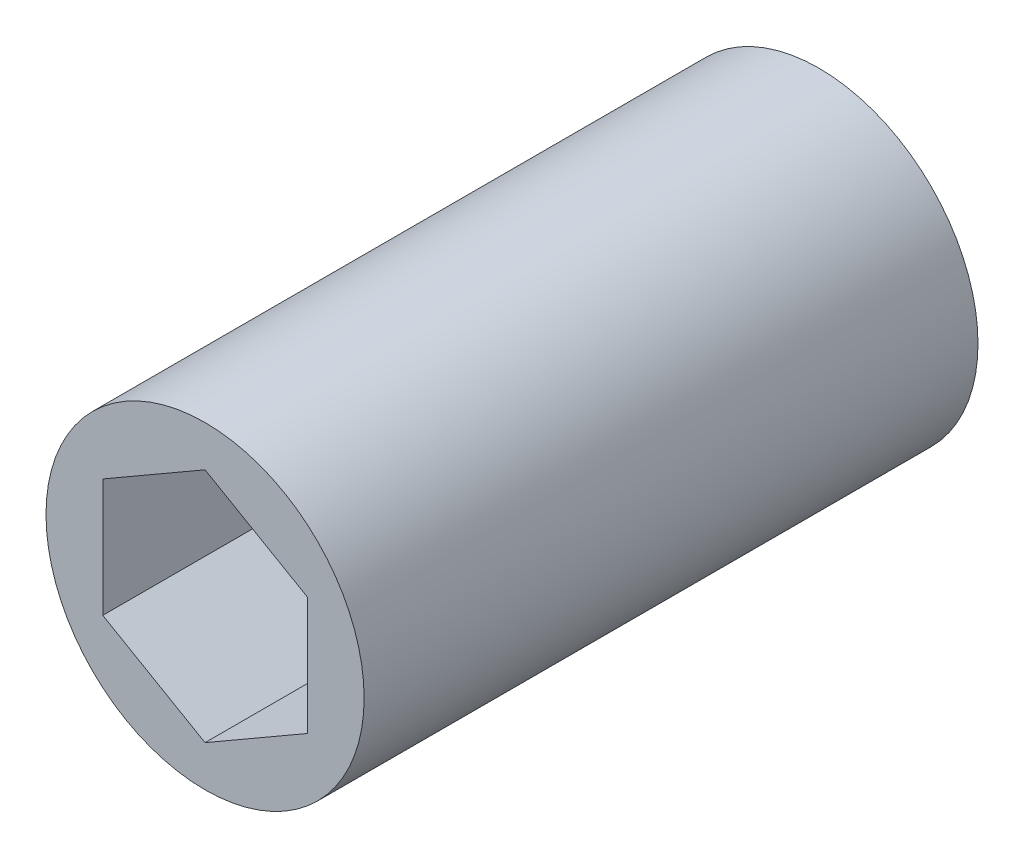
ISO-10303-21;
HEADER;
FILE_DESCRIPTION(('STEP AP214'),'2;1');
FILE_NAME('part.step','',(''),(''),'','','');
FILE_SCHEMA(('AUTOMOTIVE_DESIGN { 1 0 10303 214 1 1 1 1 }'));
ENDSEC;
DATA;
#1=APPLICATION_CONTEXT('core data for automotive mechanical design processes');
#2=APPLICATION_PROTOCOL_DEFINITION('international standard','automotive_design',2000,#1);
#3=PRODUCT_CONTEXT('',#1,'mechanical');
#4=PRODUCT('Part','Part','',(#3));
#5=PRODUCT_RELATED_PRODUCT_CATEGORY('part','',(#4));
#6=PRODUCT_DEFINITION_FORMATION('','',#4);
#7=PRODUCT_DEFINITION_CONTEXT('part definition',#1,'design');
#8=PRODUCT_DEFINITION('design','',#6,#7);
#9=PRODUCT_DEFINITION_SHAPE('','',#8);
#10=(LENGTH_UNIT() NAMED_UNIT(*) SI_UNIT(.MILLI.,.METRE.));
#11=(NAMED_UNIT(*) PLANE_ANGLE_UNIT() SI_UNIT($,.RADIAN.));
#12=(NAMED_UNIT(*) SI_UNIT($,.STERADIAN.) SOLID_ANGLE_UNIT());
#13=UNCERTAINTY_MEASURE_WITH_UNIT(LENGTH_MEASURE(1.E-05),#10,'distance_accuracy_value','');
#14=(GEOMETRIC_REPRESENTATION_CONTEXT(3) GLOBAL_UNCERTAINTY_ASSIGNED_CONTEXT((#13)) GLOBAL_UNIT_ASSIGNED_CONTEXT((#10,
#11,#12)) REPRESENTATION_CONTEXT('',''));
#15=CARTESIAN_POINT('',(0.,0.,0.));
#16=DIRECTION('',(0.,0.,1.));
#17=DIRECTION('',(1.,0.,0.));
#18=AXIS2_PLACEMENT_3D('',#15,#16,#17);
#19=CARTESIAN_POINT('',(-98.75212267549,2.16506350946108,15.));
#20=DIRECTION('',(-0.5,-0.866025403784438,0.));
#21=DIRECTION('',(0.866025403784438,-0.5,0.));
#22=AXIS2_PLACEMENT_3D('',#19,#20,#21);
#23=PLANE('',#22);
#24=DIRECTION('',(-0.866025403784438,0.5,0.));
#25=VECTOR('',#24,1.);
#26=CARTESIAN_POINT('',(-98.75212267549,2.16506350946108,0.));
#27=LINE('',#26,#25);
#28=CARTESIAN_POINT('',(-97.50212267549,1.44337567297406,0.));
#29=VERTEX_POINT('',#28);
#30=CARTESIAN_POINT('',(-100.00212267549,2.88675134594813,0.));
#31=VERTEX_POINT('',#30);
#32=EDGE_CURVE('E11',#29,#31,#27,.T.);
#33=ORIENTED_EDGE('',*,*,#32,.F.);
#34=DIRECTION('',(0.,0.,-1.));
#35=VECTOR('',#34,1.);
#36=CARTESIAN_POINT('',(-97.50212267549,1.44337567297406,15.));
#37=LINE('',#36,#35);
#38=CARTESIAN_POINT('',(-97.50212267549,1.44337567297406,15.));
#39=VERTEX_POINT('',#38);
#40=EDGE_CURVE('E23',#39,#29,#37,.T.);
#41=ORIENTED_EDGE('',*,*,#40,.F.);
#42=DIRECTION('',(-0.866025403784438,0.5,0.));
#43=VECTOR('',#42,1.);
#44=CARTESIAN_POINT('',(-98.75212267549,2.16506350946108,15.));
#45=LINE('',#44,#43);
#46=CARTESIAN_POINT('',(-100.00212267549,2.88675134594813,15.));
#47=VERTEX_POINT('',#46);
#48=EDGE_CURVE('E119',#39,#47,#45,.T.);
#49=ORIENTED_EDGE('',*,*,#48,.T.);
#50=DIRECTION('',(0.,0.,-1.));
#51=VECTOR('',#50,1.);
#52=CARTESIAN_POINT('',(-100.00212267549,2.88675134594813,15.));
#53=LINE('',#52,#51);
#54=EDGE_CURVE('E80',#47,#31,#53,.T.);
#55=ORIENTED_EDGE('',*,*,#54,.T.);
#56=EDGE_LOOP('',(#33,#41,#49,#55));
#57=FACE_BOUND('',#56,.T.);
#58=ADVANCED_FACE('F16',(#57),#23,.T.);
#59=CARTESIAN_POINT('',(-97.50212267549,0.,15.));
#60=DIRECTION('',(-1.,0.,0.));
#61=DIRECTION('',(0.,0.,1.));
#62=AXIS2_PLACEMENT_3D('',#59,#60,#61);
#63=PLANE('',#62);
#64=DIRECTION('',(0.,1.,0.));
#65=VECTOR('',#64,1.);
#66=CARTESIAN_POINT('',(-97.50212267549,0.,0.));
#67=LINE('',#66,#65);
#68=CARTESIAN_POINT('',(-97.5021226754899,-1.44337567297406,0.));
#69=VERTEX_POINT('',#68);
#70=EDGE_CURVE('E115',#69,#29,#67,.T.);
#71=ORIENTED_EDGE('',*,*,#70,.F.);
#72=DIRECTION('',(0.,0.,-1.));
#73=VECTOR('',#72,1.);
#74=CARTESIAN_POINT('',(-97.5021226754899,-1.44337567297406,15.));
#75=LINE('',#74,#73);
#76=CARTESIAN_POINT('',(-97.5021226754899,-1.44337567297406,15.));
#77=VERTEX_POINT('',#76);
#78=EDGE_CURVE('E112',#77,#69,#75,.T.);
#79=ORIENTED_EDGE('',*,*,#78,.F.);
#80=DIRECTION('',(0.,1.,0.));
#81=VECTOR('',#80,1.);
#82=CARTESIAN_POINT('',(-97.50212267549,0.,15.));
#83=LINE('',#82,#81);
#84=EDGE_CURVE('E110',#77,#39,#83,.T.);
#85=ORIENTED_EDGE('',*,*,#84,.T.);
#86=ORIENTED_EDGE('',*,*,#40,.T.);
#87=EDGE_LOOP('',(#71,#79,#85,#86));
#88=FACE_BOUND('',#87,.T.);
#89=ADVANCED_FACE('F121',(#88),#63,.T.);
#90=CARTESIAN_POINT('',(-98.7521226754899,-2.1650635094611,15.));
#91=DIRECTION('',(-0.5,0.866025403784439,0.));
#92=DIRECTION('',(-0.866025403784439,-0.5,0.));
#93=AXIS2_PLACEMENT_3D('',#90,#91,#92);
#94=PLANE('',#93);
#95=DIRECTION('',(0.866025403784439,0.5,0.));
#96=VECTOR('',#95,1.);
#97=CARTESIAN_POINT('',(-98.7521226754899,-2.1650635094611,0.));
#98=LINE('',#97,#96);
#99=CARTESIAN_POINT('',(-100.00212267549,-2.88675134594815,0.));
#100=VERTEX_POINT('',#99);
#101=EDGE_CURVE('E107',#100,#69,#98,.T.);
#102=ORIENTED_EDGE('',*,*,#101,.F.);
#103=DIRECTION('',(0.,0.,-1.));
#104=VECTOR('',#103,1.);
#105=CARTESIAN_POINT('',(-100.00212267549,-2.88675134594815,15.));
#106=LINE('',#105,#104);
#107=CARTESIAN_POINT('',(-100.00212267549,-2.88675134594815,15.));
#108=VERTEX_POINT('',#107);
#109=EDGE_CURVE('E104',#108,#100,#106,.T.);
#110=ORIENTED_EDGE('',*,*,#109,.F.);
#111=DIRECTION('',(0.866025403784439,0.5,0.));
#112=VECTOR('',#111,1.);
#113=CARTESIAN_POINT('',(-98.7521226754899,-2.1650635094611,15.));
#114=LINE('',#113,#112);
#115=EDGE_CURVE('E101',#108,#77,#114,.T.);
#116=ORIENTED_EDGE('',*,*,#115,.T.);
#117=ORIENTED_EDGE('',*,*,#78,.T.);
#118=EDGE_LOOP('',(#102,#110,#116,#117));
#119=FACE_BOUND('',#118,.T.);
#120=ADVANCED_FACE('F127',(#119),#94,.T.);
#121=CARTESIAN_POINT('',(-101.25212267549,-2.16506350946112,15.));
#122=DIRECTION('',(0.5,0.866025403784438,0.));
#123=DIRECTION('',(-0.866025403784438,0.5,0.));
#124=AXIS2_PLACEMENT_3D('',#121,#122,#123);
#125=PLANE('',#124);
#126=DIRECTION('',(0.866025403784438,-0.5,0.));
#127=VECTOR('',#126,1.);
#128=CARTESIAN_POINT('',(-101.25212267549,-2.16506350946112,0.));
#129=LINE('',#128,#127);
#130=CARTESIAN_POINT('',(-102.50212267549,-1.44337567297408,0.));
#131=VERTEX_POINT('',#130);
#132=EDGE_CURVE('E98',#131,#100,#129,.T.);
#133=ORIENTED_EDGE('',*,*,#132,.F.);
#134=DIRECTION('',(0.,0.,-1.));
#135=VECTOR('',#134,1.);
#136=CARTESIAN_POINT('',(-102.50212267549,-1.44337567297408,15.));
#137=LINE('',#136,#135);
#138=CARTESIAN_POINT('',(-102.50212267549,-1.44337567297408,15.));
#139=VERTEX_POINT('',#138);
#140=EDGE_CURVE('E96',#139,#131,#137,.T.);
#141=ORIENTED_EDGE('',*,*,#140,.F.);
#142=DIRECTION('',(0.866025403784438,-0.5,0.));
#143=VECTOR('',#142,1.);
#144=CARTESIAN_POINT('',(-101.25212267549,-2.16506350946112,15.));
#145=LINE('',#144,#143);
#146=EDGE_CURVE('E90',#139,#108,#145,.T.);
#147=ORIENTED_EDGE('',*,*,#146,.T.);
#148=ORIENTED_EDGE('',*,*,#109,.T.);
#149=EDGE_LOOP('',(#133,#141,#147,#148));
#150=FACE_BOUND('',#149,.T.);
#151=ADVANCED_FACE('F129',(#150),#125,.T.);
#152=CARTESIAN_POINT('',(-102.50212267549,0.,15.));
#153=DIRECTION('',(1.,0.,0.));
#154=DIRECTION('',(0.,0.,-1.));
#155=AXIS2_PLACEMENT_3D('',#152,#153,#154);
#156=PLANE('',#155);
#157=DIRECTION('',(0.,-1.,0.));
#158=VECTOR('',#157,1.);
#159=CARTESIAN_POINT('',(-102.50212267549,0.,0.));
#160=LINE('',#159,#158);
#161=CARTESIAN_POINT('',(-102.50212267549,1.44337567297407,0.));
#162=VERTEX_POINT('',#161);
#163=EDGE_CURVE('E71',#162,#131,#160,.T.);
#164=ORIENTED_EDGE('',*,*,#163,.F.);
#165=DIRECTION('',(0.,0.,-1.));
#166=VECTOR('',#165,1.);
#167=CARTESIAN_POINT('',(-102.50212267549,1.44337567297407,15.));
#168=LINE('',#167,#166);
#169=CARTESIAN_POINT('',(-102.50212267549,1.44337567297407,15.));
#170=VERTEX_POINT('',#169);
#171=EDGE_CURVE('E63',#170,#162,#168,.T.);
#172=ORIENTED_EDGE('',*,*,#171,.F.);
#173=DIRECTION('',(0.,-1.,0.));
#174=VECTOR('',#173,1.);
#175=CARTESIAN_POINT('',(-102.50212267549,0.,15.));
#176=LINE('',#175,#174);
#177=EDGE_CURVE('E68',#170,#139,#176,.T.);
#178=ORIENTED_EDGE('',*,*,#177,.T.);
#179=ORIENTED_EDGE('',*,*,#140,.T.);
#180=EDGE_LOOP('',(#164,#172,#178,#179));
#181=FACE_BOUND('',#180,.T.);
#182=ADVANCED_FACE('F65',(#181),#156,.T.);
#183=CARTESIAN_POINT('',(-101.25212267549,2.1650635094611,15.));
#184=DIRECTION('',(0.5,-0.86602540378444,0.));
#185=DIRECTION('',(0.86602540378444,0.5,0.));
#186=AXIS2_PLACEMENT_3D('',#183,#184,#185);
#187=PLANE('',#186);
#188=DIRECTION('',(-0.866025403784439,-0.499999999999999,0.));
#189=VECTOR('',#188,1.);
#190=CARTESIAN_POINT('',(-101.25212267549,2.1650635094611,0.));
#191=LINE('',#190,#189);
#192=EDGE_CURVE('E83',#31,#162,#191,.T.);
#193=ORIENTED_EDGE('',*,*,#192,.F.);
#194=ORIENTED_EDGE('',*,*,#54,.F.);
#195=DIRECTION('',(-0.866025403784439,-0.499999999999999,0.));
#196=VECTOR('',#195,1.);
#197=CARTESIAN_POINT('',(-101.25212267549,2.1650635094611,15.));
#198=LINE('',#197,#196);
#199=EDGE_CURVE('E78',#47,#170,#198,.T.);
#200=ORIENTED_EDGE('',*,*,#199,.T.);
#201=ORIENTED_EDGE('',*,*,#171,.T.);
#202=EDGE_LOOP('',(#193,#194,#200,#201));
#203=FACE_BOUND('',#202,.T.);
#204=ADVANCED_FACE('F79',(#203),#187,.T.);
#205=CARTESIAN_POINT('',(-100.00212267549,0.,15.));
#206=DIRECTION('',(0.,0.,-1.));
#207=DIRECTION('',(-1.,0.,0.));
#208=AXIS2_PLACEMENT_3D('',#205,#206,#207);
#209=CYLINDRICAL_SURFACE('',#208,3.88675134594811);
#210=CARTESIAN_POINT('',(-100.00212267549,0.,15.));
#211=DIRECTION('',(0.,0.,1.));
#212=DIRECTION('',(1.,0.,0.));
#213=AXIS2_PLACEMENT_3D('',#210,#211,#212);
#214=CIRCLE('',#213,3.88675134594811);
#215=CARTESIAN_POINT('',(-96.1153713295419,0.,15.));
#216=VERTEX_POINT('',#215);
#217=EDGE_CURVE('E84',#216,#216,#214,.T.);
#218=ORIENTED_EDGE('',*,*,#217,.F.);
#219=EDGE_LOOP('',(#218));
#220=FACE_BOUND('',#219,.T.);
#221=CARTESIAN_POINT('',(-100.00212267549,0.,0.));
#222=DIRECTION('',(0.,0.,1.));
#223=DIRECTION('',(1.,0.,0.));
#224=AXIS2_PLACEMENT_3D('',#221,#222,#223);
#225=CIRCLE('',#224,3.88675134594811);
#226=CARTESIAN_POINT('',(-96.1153713295419,0.,0.));
#227=VERTEX_POINT('',#226);
#228=EDGE_CURVE('E220',#227,#227,#225,.T.);
#229=ORIENTED_EDGE('',*,*,#228,.T.);
#230=EDGE_LOOP('',(#229));
#231=FACE_BOUND('',#230,.T.);
#232=ADVANCED_FACE('F146',(#220,#231),#209,.T.);
#233=CARTESIAN_POINT('',(-85.50212267549,0.,15.));
#234=DIRECTION('',(0.,0.,1.));
#235=DIRECTION('',(1.,0.,0.));
#236=AXIS2_PLACEMENT_3D('',#233,#234,#235);
#237=PLANE('',#236);
#238=ORIENTED_EDGE('',*,*,#48,.F.);
#239=ORIENTED_EDGE('',*,*,#84,.F.);
#240=ORIENTED_EDGE('',*,*,#115,.F.);
#241=ORIENTED_EDGE('',*,*,#146,.F.);
#242=ORIENTED_EDGE('',*,*,#177,.F.);
#243=ORIENTED_EDGE('',*,*,#199,.F.);
#244=EDGE_LOOP('',(#238,#239,#240,#241,#242,#243));
#245=FACE_BOUND('',#244,.T.);
#246=ORIENTED_EDGE('',*,*,#217,.T.);
#247=EDGE_LOOP('',(#246));
#248=FACE_BOUND('',#247,.T.);
#249=ADVANCED_FACE('F86',(#245,#248),#237,.T.);
#250=CARTESIAN_POINT('',(-85.50212267549,0.,0.));
#251=DIRECTION('',(0.,0.,1.));
#252=DIRECTION('',(1.,0.,0.));
#253=AXIS2_PLACEMENT_3D('',#250,#251,#252);
#254=PLANE('',#253);
#255=ORIENTED_EDGE('',*,*,#32,.T.);
#256=ORIENTED_EDGE('',*,*,#192,.T.);
#257=ORIENTED_EDGE('',*,*,#163,.T.);
#258=ORIENTED_EDGE('',*,*,#132,.T.);
#259=ORIENTED_EDGE('',*,*,#101,.T.);
#260=ORIENTED_EDGE('',*,*,#70,.T.);
#261=EDGE_LOOP('',(#255,#256,#257,#258,#259,#260));
#262=FACE_BOUND('',#261,.T.);
#263=ORIENTED_EDGE('',*,*,#228,.F.);
#264=EDGE_LOOP('',(#263));
#265=FACE_BOUND('',#264,.T.);
#266=ADVANCED_FACE('F124',(#262,#265),#254,.F.);
#267=CLOSED_SHELL('',(#58,#89,#120,#151,#182,#204,#232,#249,#266));
#268=MANIFOLD_SOLID_BREP('B1',#267);
#269=ADVANCED_BREP_SHAPE_REPRESENTATION('',(#18,#268),#14);
#270=SHAPE_DEFINITION_REPRESENTATION(#9,#269);
ENDSEC;
END-ISO-10303-21;
